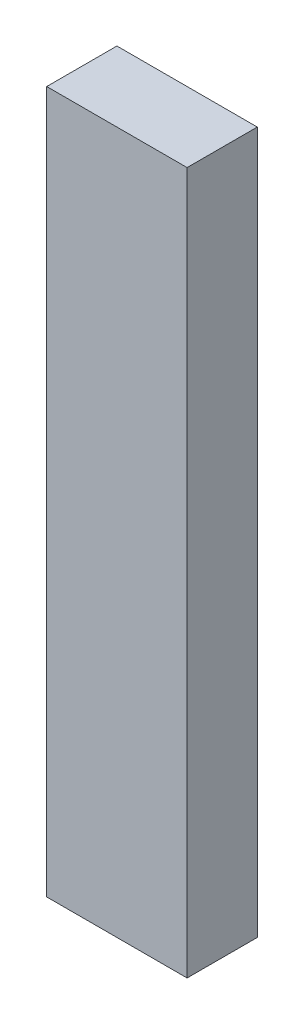
ISO-10303-21;
HEADER;
FILE_DESCRIPTION(('STEP AP214'),'2;1');
FILE_NAME('part.step','',(''),(''),'','','');
FILE_SCHEMA(('AUTOMOTIVE_DESIGN { 1 0 10303 214 1 1 1 1 }'));
ENDSEC;
DATA;
#1=APPLICATION_CONTEXT('core data for automotive mechanical design processes');
#2=APPLICATION_PROTOCOL_DEFINITION('international standard','automotive_design',2000,#1);
#3=PRODUCT_CONTEXT('',#1,'mechanical');
#4=PRODUCT('Part','Part','',(#3));
#5=PRODUCT_RELATED_PRODUCT_CATEGORY('part','',(#4));
#6=PRODUCT_DEFINITION_FORMATION('','',#4);
#7=PRODUCT_DEFINITION_CONTEXT('part definition',#1,'design');
#8=PRODUCT_DEFINITION('design','',#6,#7);
#9=PRODUCT_DEFINITION_SHAPE('','',#8);
#10=(LENGTH_UNIT() NAMED_UNIT(*) SI_UNIT(.MILLI.,.METRE.));
#11=(NAMED_UNIT(*) PLANE_ANGLE_UNIT() SI_UNIT($,.RADIAN.));
#12=(NAMED_UNIT(*) SI_UNIT($,.STERADIAN.) SOLID_ANGLE_UNIT());
#13=UNCERTAINTY_MEASURE_WITH_UNIT(LENGTH_MEASURE(1.E-05),#10,'distance_accuracy_value','');
#14=(GEOMETRIC_REPRESENTATION_CONTEXT(3) GLOBAL_UNCERTAINTY_ASSIGNED_CONTEXT((#13)) GLOBAL_UNIT_ASSIGNED_CONTEXT((#10,
#11,#12)) REPRESENTATION_CONTEXT('',''));
#15=CARTESIAN_POINT('',(0.,0.,0.));
#16=DIRECTION('',(0.,0.,1.));
#17=DIRECTION('',(1.,0.,0.));
#18=AXIS2_PLACEMENT_3D('',#15,#16,#17);
#19=CARTESIAN_POINT('',(0.,0.,12.7));
#20=DIRECTION('',(0.,1.,0.));
#21=DIRECTION('',(0.,0.,1.));
#22=AXIS2_PLACEMENT_3D('',#19,#20,#21);
#23=PLANE('',#22);
#24=DIRECTION('',(0.,0.,-1.));
#25=VECTOR('',#24,1.);
#26=CARTESIAN_POINT('',(12.7,0.,12.7));
#27=LINE('',#26,#25);
#28=CARTESIAN_POINT('',(12.7,0.,12.7));
#29=VERTEX_POINT('',#28);
#30=CARTESIAN_POINT('',(12.7,0.,0.));
#31=VERTEX_POINT('',#30);
#32=EDGE_CURVE('E12',#29,#31,#27,.T.);
#33=ORIENTED_EDGE('',*,*,#32,.F.);
#34=DIRECTION('',(1.,0.,0.));
#35=VECTOR('',#34,1.);
#36=CARTESIAN_POINT('',(0.,0.,12.7));
#37=LINE('',#36,#35);
#38=CARTESIAN_POINT('',(0.,0.,12.7));
#39=VERTEX_POINT('',#38);
#40=EDGE_CURVE('E104',#39,#29,#37,.T.);
#41=ORIENTED_EDGE('',*,*,#40,.F.);
#42=DIRECTION('',(0.,0.,-1.));
#43=VECTOR('',#42,1.);
#44=CARTESIAN_POINT('',(0.,0.,12.7));
#45=LINE('',#44,#43);
#46=CARTESIAN_POINT('',(0.,0.,0.));
#47=VERTEX_POINT('',#46);
#48=EDGE_CURVE('E58',#39,#47,#45,.T.);
#49=ORIENTED_EDGE('',*,*,#48,.T.);
#50=DIRECTION('',(1.,0.,0.));
#51=VECTOR('',#50,1.);
#52=CARTESIAN_POINT('',(0.,0.,0.));
#53=LINE('',#52,#51);
#54=EDGE_CURVE('E92',#47,#31,#53,.T.);
#55=ORIENTED_EDGE('',*,*,#54,.T.);
#56=EDGE_LOOP('',(#33,#41,#49,#55));
#57=FACE_BOUND('',#56,.T.);
#58=ADVANCED_FACE('F48',(#57),#23,.F.);
#59=CARTESIAN_POINT('',(0.,0.,12.7));
#60=DIRECTION('',(1.,0.,0.));
#61=DIRECTION('',(0.,1.,0.));
#62=AXIS2_PLACEMENT_3D('',#59,#60,#61);
#63=PLANE('',#62);
#64=DIRECTION('',(0.,-1.,0.));
#65=VECTOR('',#64,1.);
#66=CARTESIAN_POINT('',(0.,0.,0.));
#67=LINE('',#66,#65);
#68=CARTESIAN_POINT('',(0.,127.,0.));
#69=VERTEX_POINT('',#68);
#70=EDGE_CURVE('E97',#69,#47,#67,.T.);
#71=ORIENTED_EDGE('',*,*,#70,.T.);
#72=ORIENTED_EDGE('',*,*,#48,.F.);
#73=DIRECTION('',(0.,-1.,0.));
#74=VECTOR('',#73,1.);
#75=CARTESIAN_POINT('',(0.,0.,12.7));
#76=LINE('',#75,#74);
#77=CARTESIAN_POINT('',(0.,127.,12.7));
#78=VERTEX_POINT('',#77);
#79=EDGE_CURVE('E117',#78,#39,#76,.T.);
#80=ORIENTED_EDGE('',*,*,#79,.F.);
#81=DIRECTION('',(0.,0.,-1.));
#82=VECTOR('',#81,1.);
#83=CARTESIAN_POINT('',(0.,127.,12.7));
#84=LINE('',#83,#82);
#85=EDGE_CURVE('E111',#78,#69,#84,.T.);
#86=ORIENTED_EDGE('',*,*,#85,.T.);
#87=EDGE_LOOP('',(#71,#72,#80,#86));
#88=FACE_BOUND('',#87,.T.);
#89=ADVANCED_FACE('F50',(#88),#63,.F.);
#90=CARTESIAN_POINT('',(25.4,0.,12.7));
#91=VERTEX_POINT('',#90);
#92=EDGE_CURVE('E118',#29,#91,#37,.T.);
#93=ORIENTED_EDGE('',*,*,#92,.F.);
#94=ORIENTED_EDGE('',*,*,#32,.T.);
#95=CARTESIAN_POINT('',(25.4,0.,0.));
#96=VERTEX_POINT('',#95);
#97=EDGE_CURVE('E99',#31,#96,#53,.T.);
#98=ORIENTED_EDGE('',*,*,#97,.T.);
#99=DIRECTION('',(0.,0.,-1.));
#100=VECTOR('',#99,1.);
#101=CARTESIAN_POINT('',(25.4,0.,12.7));
#102=LINE('',#101,#100);
#103=EDGE_CURVE('E108',#91,#96,#102,.T.);
#104=ORIENTED_EDGE('',*,*,#103,.F.);
#105=EDGE_LOOP('',(#93,#94,#98,#104));
#106=FACE_BOUND('',#105,.T.);
#107=ADVANCED_FACE('F147',(#106),#23,.F.);
#108=CARTESIAN_POINT('',(25.4,0.,12.7));
#109=DIRECTION('',(-1.,0.,0.));
#110=DIRECTION('',(0.,-1.,0.));
#111=AXIS2_PLACEMENT_3D('',#108,#109,#110);
#112=PLANE('',#111);
#113=DIRECTION('',(0.,1.,0.));
#114=VECTOR('',#113,1.);
#115=CARTESIAN_POINT('',(25.4,0.,0.));
#116=LINE('',#115,#114);
#117=CARTESIAN_POINT('',(25.4,127.,0.));
#118=VERTEX_POINT('',#117);
#119=EDGE_CURVE('E100',#96,#118,#116,.T.);
#120=ORIENTED_EDGE('',*,*,#119,.T.);
#121=DIRECTION('',(0.,0.,-1.));
#122=VECTOR('',#121,1.);
#123=CARTESIAN_POINT('',(25.4,127.,12.7));
#124=LINE('',#123,#122);
#125=CARTESIAN_POINT('',(25.4,127.,12.7));
#126=VERTEX_POINT('',#125);
#127=EDGE_CURVE('E129',#126,#118,#124,.T.);
#128=ORIENTED_EDGE('',*,*,#127,.F.);
#129=DIRECTION('',(0.,1.,0.));
#130=VECTOR('',#129,1.);
#131=CARTESIAN_POINT('',(25.4,0.,12.7));
#132=LINE('',#131,#130);
#133=EDGE_CURVE('E121',#91,#126,#132,.T.);
#134=ORIENTED_EDGE('',*,*,#133,.F.);
#135=ORIENTED_EDGE('',*,*,#103,.T.);
#136=EDGE_LOOP('',(#120,#128,#134,#135));
#137=FACE_BOUND('',#136,.T.);
#138=ADVANCED_FACE('F136',(#137),#112,.F.);
#139=CARTESIAN_POINT('',(0.,127.,12.7));
#140=DIRECTION('',(0.,-1.,0.));
#141=DIRECTION('',(0.,0.,-1.));
#142=AXIS2_PLACEMENT_3D('',#139,#140,#141);
#143=PLANE('',#142);
#144=DIRECTION('',(-1.,0.,0.));
#145=VECTOR('',#144,1.);
#146=CARTESIAN_POINT('',(0.,127.,0.));
#147=LINE('',#146,#145);
#148=EDGE_CURVE('E115',#118,#69,#147,.T.);
#149=ORIENTED_EDGE('',*,*,#148,.T.);
#150=ORIENTED_EDGE('',*,*,#85,.F.);
#151=DIRECTION('',(-1.,0.,0.));
#152=VECTOR('',#151,1.);
#153=CARTESIAN_POINT('',(0.,127.,12.7));
#154=LINE('',#153,#152);
#155=EDGE_CURVE('E125',#126,#78,#154,.T.);
#156=ORIENTED_EDGE('',*,*,#155,.F.);
#157=ORIENTED_EDGE('',*,*,#127,.T.);
#158=EDGE_LOOP('',(#149,#150,#156,#157));
#159=FACE_BOUND('',#158,.T.);
#160=ADVANCED_FACE('F139',(#159),#143,.F.);
#161=CARTESIAN_POINT('',(0.,127.,12.7));
#162=DIRECTION('',(0.,0.,-1.));
#163=DIRECTION('',(-1.,0.,0.));
#164=AXIS2_PLACEMENT_3D('',#161,#162,#163);
#165=PLANE('',#164);
#166=ORIENTED_EDGE('',*,*,#79,.T.);
#167=ORIENTED_EDGE('',*,*,#40,.T.);
#168=ORIENTED_EDGE('',*,*,#92,.T.);
#169=ORIENTED_EDGE('',*,*,#133,.T.);
#170=ORIENTED_EDGE('',*,*,#155,.T.);
#171=EDGE_LOOP('',(#166,#167,#168,#169,#170));
#172=FACE_BOUND('',#171,.T.);
#173=ADVANCED_FACE('F142',(#172),#165,.F.);
#174=CARTESIAN_POINT('',(0.,127.,0.));
#175=DIRECTION('',(0.,0.,-1.));
#176=DIRECTION('',(-1.,0.,0.));
#177=AXIS2_PLACEMENT_3D('',#174,#175,#176);
#178=PLANE('',#177);
#179=ORIENTED_EDGE('',*,*,#70,.F.);
#180=ORIENTED_EDGE('',*,*,#148,.F.);
#181=ORIENTED_EDGE('',*,*,#119,.F.);
#182=ORIENTED_EDGE('',*,*,#97,.F.);
#183=ORIENTED_EDGE('',*,*,#54,.F.);
#184=EDGE_LOOP('',(#179,#180,#181,#182,#183));
#185=FACE_BOUND('',#184,.T.);
#186=ADVANCED_FACE('F94',(#185),#178,.T.);
#187=CLOSED_SHELL('',(#58,#89,#107,#138,#160,#173,#186));
#188=MANIFOLD_SOLID_BREP('B2',#187);
#189=ADVANCED_BREP_SHAPE_REPRESENTATION('',(#18,#188),#14);
#190=SHAPE_DEFINITION_REPRESENTATION(#9,#189);
ENDSEC;
END-ISO-10303-21;
